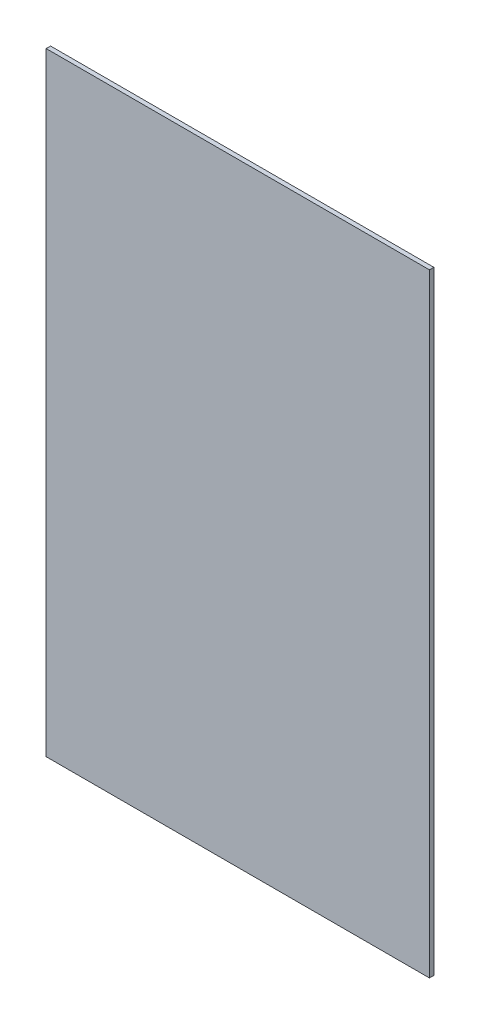
ISO-10303-21;
HEADER;
FILE_DESCRIPTION(('STEP AP214'),'2;1');
FILE_NAME('part.step','',(''),(''),'','','');
FILE_SCHEMA(('AUTOMOTIVE_DESIGN { 1 0 10303 214 1 1 1 1 }'));
ENDSEC;
DATA;
#1=APPLICATION_CONTEXT('core data for automotive mechanical design processes');
#2=APPLICATION_PROTOCOL_DEFINITION('international standard','automotive_design',2000,#1);
#3=PRODUCT_CONTEXT('',#1,'mechanical');
#4=PRODUCT('Part','Part','',(#3));
#5=PRODUCT_RELATED_PRODUCT_CATEGORY('part','',(#4));
#6=PRODUCT_DEFINITION_FORMATION('','',#4);
#7=PRODUCT_DEFINITION_CONTEXT('part definition',#1,'design');
#8=PRODUCT_DEFINITION('design','',#6,#7);
#9=PRODUCT_DEFINITION_SHAPE('','',#8);
#10=(LENGTH_UNIT() NAMED_UNIT(*) SI_UNIT(.MILLI.,.METRE.));
#11=(NAMED_UNIT(*) PLANE_ANGLE_UNIT() SI_UNIT($,.RADIAN.));
#12=(NAMED_UNIT(*) SI_UNIT($,.STERADIAN.) SOLID_ANGLE_UNIT());
#13=UNCERTAINTY_MEASURE_WITH_UNIT(LENGTH_MEASURE(1.E-05),#10,'distance_accuracy_value','');
#14=(GEOMETRIC_REPRESENTATION_CONTEXT(3) GLOBAL_UNCERTAINTY_ASSIGNED_CONTEXT((#13)) GLOBAL_UNIT_ASSIGNED_CONTEXT((#10,
#11,#12)) REPRESENTATION_CONTEXT('',''));
#15=CARTESIAN_POINT('',(0.,0.,0.));
#16=DIRECTION('',(0.,0.,1.));
#17=DIRECTION('',(1.,0.,0.));
#18=AXIS2_PLACEMENT_3D('',#15,#16,#17);
#19=CARTESIAN_POINT('',(39.6875,-63.5,-0.91186));
#20=DIRECTION('',(1.,0.,0.));
#21=DIRECTION('',(0.,0.,-1.));
#22=AXIS2_PLACEMENT_3D('',#19,#20,#21);
#23=PLANE('',#22);
#24=DIRECTION('',(0.,1.,0.));
#25=VECTOR('',#24,1.);
#26=CARTESIAN_POINT('',(39.6875,-63.5,0.));
#27=LINE('',#26,#25);
#28=CARTESIAN_POINT('',(39.6875,-63.5,0.));
#29=VERTEX_POINT('',#28);
#30=CARTESIAN_POINT('',(39.6875,63.5,0.));
#31=VERTEX_POINT('',#30);
#32=EDGE_CURVE('E105',#29,#31,#27,.T.);
#33=ORIENTED_EDGE('',*,*,#32,.F.);
#34=DIRECTION('',(0.,0.,1.));
#35=VECTOR('',#34,1.);
#36=CARTESIAN_POINT('',(39.6875,-63.5,-0.91186));
#37=LINE('',#36,#35);
#38=CARTESIAN_POINT('',(39.6875,-63.5,-0.91186));
#39=VERTEX_POINT('',#38);
#40=EDGE_CURVE('E11',#39,#29,#37,.T.);
#41=ORIENTED_EDGE('',*,*,#40,.F.);
#42=DIRECTION('',(0.,1.,0.));
#43=VECTOR('',#42,1.);
#44=CARTESIAN_POINT('',(39.6875,-63.5,-0.91186));
#45=LINE('',#44,#43);
#46=CARTESIAN_POINT('',(39.6875,63.5,-0.91186));
#47=VERTEX_POINT('',#46);
#48=EDGE_CURVE('E99',#39,#47,#45,.T.);
#49=ORIENTED_EDGE('',*,*,#48,.T.);
#50=DIRECTION('',(0.,0.,1.));
#51=VECTOR('',#50,1.);
#52=CARTESIAN_POINT('',(39.6875,63.5,-0.91186));
#53=LINE('',#52,#51);
#54=EDGE_CURVE('E44',#47,#31,#53,.T.);
#55=ORIENTED_EDGE('',*,*,#54,.T.);
#56=EDGE_LOOP('',(#33,#41,#49,#55));
#57=FACE_BOUND('',#56,.T.);
#58=ADVANCED_FACE('F41',(#57),#23,.T.);
#59=CARTESIAN_POINT('',(-39.6875,-63.5,-0.91186));
#60=DIRECTION('',(0.,-1.,0.));
#61=DIRECTION('',(0.,0.,-1.));
#62=AXIS2_PLACEMENT_3D('',#59,#60,#61);
#63=PLANE('',#62);
#64=DIRECTION('',(1.,0.,0.));
#65=VECTOR('',#64,1.);
#66=CARTESIAN_POINT('',(-39.6875,-63.5,0.));
#67=LINE('',#66,#65);
#68=CARTESIAN_POINT('',(-39.6875,-63.5,0.));
#69=VERTEX_POINT('',#68);
#70=EDGE_CURVE('E101',#69,#29,#67,.T.);
#71=ORIENTED_EDGE('',*,*,#70,.F.);
#72=DIRECTION('',(0.,0.,1.));
#73=VECTOR('',#72,1.);
#74=CARTESIAN_POINT('',(-39.6875,-63.5,-0.91186));
#75=LINE('',#74,#73);
#76=CARTESIAN_POINT('',(-39.6875,-63.5,-0.91186));
#77=VERTEX_POINT('',#76);
#78=EDGE_CURVE('E50',#77,#69,#75,.T.);
#79=ORIENTED_EDGE('',*,*,#78,.F.);
#80=DIRECTION('',(1.,0.,0.));
#81=VECTOR('',#80,1.);
#82=CARTESIAN_POINT('',(-39.6875,-63.5,-0.91186));
#83=LINE('',#82,#81);
#84=EDGE_CURVE('E96',#77,#39,#83,.T.);
#85=ORIENTED_EDGE('',*,*,#84,.T.);
#86=ORIENTED_EDGE('',*,*,#40,.T.);
#87=EDGE_LOOP('',(#71,#79,#85,#86));
#88=FACE_BOUND('',#87,.T.);
#89=ADVANCED_FACE('F115',(#88),#63,.T.);
#90=CARTESIAN_POINT('',(-39.6875,-63.5,-0.91186));
#91=DIRECTION('',(-1.,0.,0.));
#92=DIRECTION('',(0.,0.,1.));
#93=AXIS2_PLACEMENT_3D('',#90,#91,#92);
#94=PLANE('',#93);
#95=DIRECTION('',(0.,-1.,0.));
#96=VECTOR('',#95,1.);
#97=CARTESIAN_POINT('',(-39.6875,-63.5,0.));
#98=LINE('',#97,#96);
#99=CARTESIAN_POINT('',(-39.6875,63.5,0.));
#100=VERTEX_POINT('',#99);
#101=EDGE_CURVE('E91',#100,#69,#98,.T.);
#102=ORIENTED_EDGE('',*,*,#101,.F.);
#103=DIRECTION('',(0.,0.,1.));
#104=VECTOR('',#103,1.);
#105=CARTESIAN_POINT('',(-39.6875,63.5,-0.91186));
#106=LINE('',#105,#104);
#107=CARTESIAN_POINT('',(-39.6875,63.5,-0.91186));
#108=VERTEX_POINT('',#107);
#109=EDGE_CURVE('E86',#108,#100,#106,.T.);
#110=ORIENTED_EDGE('',*,*,#109,.F.);
#111=DIRECTION('',(0.,-1.,0.));
#112=VECTOR('',#111,1.);
#113=CARTESIAN_POINT('',(-39.6875,-63.5,-0.91186));
#114=LINE('',#113,#112);
#115=EDGE_CURVE('E89',#108,#77,#114,.T.);
#116=ORIENTED_EDGE('',*,*,#115,.T.);
#117=ORIENTED_EDGE('',*,*,#78,.T.);
#118=EDGE_LOOP('',(#102,#110,#116,#117));
#119=FACE_BOUND('',#118,.T.);
#120=ADVANCED_FACE('F88',(#119),#94,.T.);
#121=CARTESIAN_POINT('',(-39.6875,63.5,-0.91186));
#122=DIRECTION('',(0.,1.,0.));
#123=DIRECTION('',(0.,0.,1.));
#124=AXIS2_PLACEMENT_3D('',#121,#122,#123);
#125=PLANE('',#124);
#126=DIRECTION('',(-1.,0.,0.));
#127=VECTOR('',#126,1.);
#128=CARTESIAN_POINT('',(-39.6875,63.5,0.));
#129=LINE('',#128,#127);
#130=EDGE_CURVE('E108',#31,#100,#129,.T.);
#131=ORIENTED_EDGE('',*,*,#130,.F.);
#132=ORIENTED_EDGE('',*,*,#54,.F.);
#133=DIRECTION('',(-1.,0.,0.));
#134=VECTOR('',#133,1.);
#135=CARTESIAN_POINT('',(-39.6875,63.5,-0.91186));
#136=LINE('',#135,#134);
#137=EDGE_CURVE('E95',#47,#108,#136,.T.);
#138=ORIENTED_EDGE('',*,*,#137,.T.);
#139=ORIENTED_EDGE('',*,*,#109,.T.);
#140=EDGE_LOOP('',(#131,#132,#138,#139));
#141=FACE_BOUND('',#140,.T.);
#142=ADVANCED_FACE('F98',(#141),#125,.T.);
#143=CARTESIAN_POINT('',(0.,0.,-0.91186));
#144=DIRECTION('',(0.,0.,-1.));
#145=DIRECTION('',(-1.,0.,0.));
#146=AXIS2_PLACEMENT_3D('',#143,#144,#145);
#147=PLANE('',#146);
#148=ORIENTED_EDGE('',*,*,#48,.F.);
#149=ORIENTED_EDGE('',*,*,#84,.F.);
#150=ORIENTED_EDGE('',*,*,#115,.F.);
#151=ORIENTED_EDGE('',*,*,#137,.F.);
#152=EDGE_LOOP('',(#148,#149,#150,#151));
#153=FACE_BOUND('',#152,.T.);
#154=ADVANCED_FACE('F94',(#153),#147,.T.);
#155=CARTESIAN_POINT('',(0.,0.,0.));
#156=DIRECTION('',(0.,0.,-1.));
#157=DIRECTION('',(-1.,0.,0.));
#158=AXIS2_PLACEMENT_3D('',#155,#156,#157);
#159=PLANE('',#158);
#160=ORIENTED_EDGE('',*,*,#32,.T.);
#161=ORIENTED_EDGE('',*,*,#130,.T.);
#162=ORIENTED_EDGE('',*,*,#101,.T.);
#163=ORIENTED_EDGE('',*,*,#70,.T.);
#164=EDGE_LOOP('',(#160,#161,#162,#163));
#165=FACE_BOUND('',#164,.T.);
#166=ADVANCED_FACE('F114',(#165),#159,.F.);
#167=CLOSED_SHELL('',(#58,#89,#120,#142,#154,#166));
#168=MANIFOLD_SOLID_BREP('B2',#167);
#169=ADVANCED_BREP_SHAPE_REPRESENTATION('',(#18,#168),#14);
#170=SHAPE_DEFINITION_REPRESENTATION(#9,#169);
ENDSEC;
END-ISO-10303-21;
